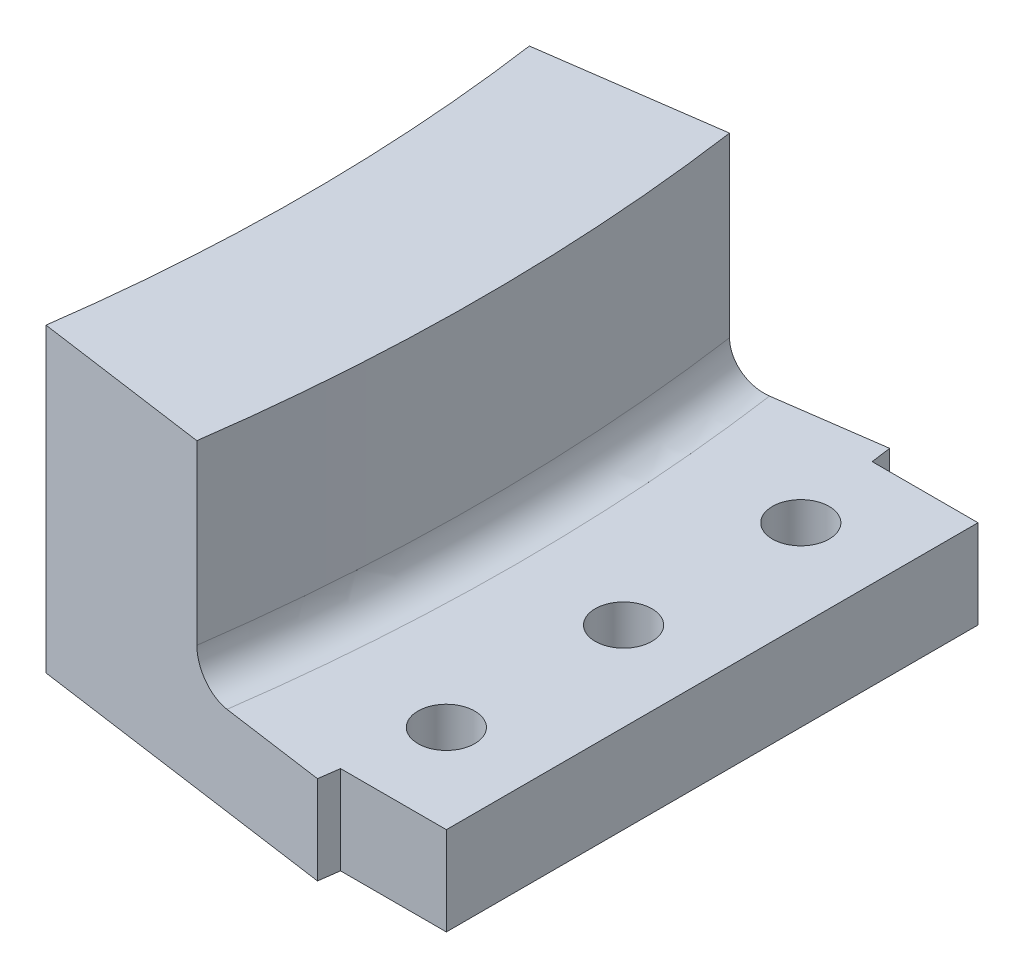
ISO-10303-21;
HEADER;
FILE_DESCRIPTION(('STEP AP214'),'2;1');
FILE_NAME('part.step','',(''),(''),'','','');
FILE_SCHEMA(('AUTOMOTIVE_DESIGN { 1 0 10303 214 1 1 1 1 }'));
ENDSEC;
DATA;
#1=APPLICATION_CONTEXT('core data for automotive mechanical design processes');
#2=APPLICATION_PROTOCOL_DEFINITION('international standard','automotive_design',2000,#1);
#3=PRODUCT_CONTEXT('',#1,'mechanical');
#4=PRODUCT('Part','Part','',(#3));
#5=PRODUCT_RELATED_PRODUCT_CATEGORY('part','',(#4));
#6=PRODUCT_DEFINITION_FORMATION('','',#4);
#7=PRODUCT_DEFINITION_CONTEXT('part definition',#1,'design');
#8=PRODUCT_DEFINITION('design','',#6,#7);
#9=PRODUCT_DEFINITION_SHAPE('','',#8);
#10=(LENGTH_UNIT() NAMED_UNIT(*) SI_UNIT(.MILLI.,.METRE.));
#11=(NAMED_UNIT(*) PLANE_ANGLE_UNIT() SI_UNIT($,.RADIAN.));
#12=(NAMED_UNIT(*) SI_UNIT($,.STERADIAN.) SOLID_ANGLE_UNIT());
#13=UNCERTAINTY_MEASURE_WITH_UNIT(LENGTH_MEASURE(1.E-05),#10,'distance_accuracy_value','');
#14=(GEOMETRIC_REPRESENTATION_CONTEXT(3) GLOBAL_UNCERTAINTY_ASSIGNED_CONTEXT((#13)) GLOBAL_UNIT_ASSIGNED_CONTEXT((#10,
#11,#12)) REPRESENTATION_CONTEXT('',''));
#15=CARTESIAN_POINT('',(0.,0.,0.));
#16=DIRECTION('',(0.,0.,1.));
#17=DIRECTION('',(1.,0.,0.));
#18=AXIS2_PLACEMENT_3D('',#15,#16,#17);
#19=CARTESIAN_POINT('',(0.,-55.,0.));
#20=DIRECTION('',(0.,-1.,0.));
#21=DIRECTION('',(0.,0.,-1.));
#22=AXIS2_PLACEMENT_3D('',#19,#20,#21);
#23=CYLINDRICAL_SURFACE('',#22,116.);
#24=CARTESIAN_POINT('',(0.,5.,0.));
#25=DIRECTION('',(0.,-1.,0.));
#26=DIRECTION('',(0.,0.,-1.));
#27=AXIS2_PLACEMENT_3D('',#24,#25,#26);
#28=CIRCLE('',#27,116.);
#29=CARTESIAN_POINT('',(114.871095974022,5.,-16.1440797113676));
#30=VERTEX_POINT('',#29);
#31=CARTESIAN_POINT('',(115.02608399837,5.,-15.));
#32=VERTEX_POINT('',#31);
#33=EDGE_CURVE('E206',#30,#32,#28,.T.);
#34=ORIENTED_EDGE('',*,*,#33,.T.);
#35=DIRECTION('',(0.,-1.,0.));
#36=VECTOR('',#35,1.);
#37=CARTESIAN_POINT('',(115.02608399837,-55.,-15.));
#38=LINE('',#37,#36);
#39=CARTESIAN_POINT('',(115.02608399837,0.,-15.));
#40=VERTEX_POINT('',#39);
#41=EDGE_CURVE('E162',#32,#40,#38,.T.);
#42=ORIENTED_EDGE('',*,*,#41,.T.);
#43=CARTESIAN_POINT('',(0.,0.,0.));
#44=DIRECTION('',(0.,-1.,0.));
#45=DIRECTION('',(0.,0.,-1.));
#46=AXIS2_PLACEMENT_3D('',#43,#44,#45);
#47=CIRCLE('',#46,116.);
#48=CARTESIAN_POINT('',(114.871095974022,0.,-16.1440797113676));
#49=VERTEX_POINT('',#48);
#50=EDGE_CURVE('E203',#49,#40,#47,.T.);
#51=ORIENTED_EDGE('',*,*,#50,.F.);
#52=DIRECTION('',(0.,1.,0.));
#53=VECTOR('',#52,1.);
#54=CARTESIAN_POINT('',(114.871095974022,0.,-16.1440797113676));
#55=LINE('',#54,#53);
#56=EDGE_CURVE('E190',#49,#30,#55,.T.);
#57=ORIENTED_EDGE('',*,*,#56,.T.);
#58=EDGE_LOOP('',(#34,#42,#51,#57));
#59=FACE_BOUND('',#58,.T.);
#60=ADVANCED_FACE('F35',(#59),#23,.T.);
#61=DIRECTION('',(0.,-1.,0.));
#62=VECTOR('',#61,1.);
#63=CARTESIAN_POINT('',(115.02608399837,-55.,15.));
#64=LINE('',#63,#62);
#65=CARTESIAN_POINT('',(115.02608399837,5.,15.));
#66=VERTEX_POINT('',#65);
#67=CARTESIAN_POINT('',(115.02608399837,0.,15.));
#68=VERTEX_POINT('',#67);
#69=EDGE_CURVE('E136',#66,#68,#64,.T.);
#70=ORIENTED_EDGE('',*,*,#69,.F.);
#71=CARTESIAN_POINT('',(114.871095974022,5.,16.1440797113676));
#72=VERTEX_POINT('',#71);
#73=EDGE_CURVE('E205',#66,#72,#28,.T.);
#74=ORIENTED_EDGE('',*,*,#73,.T.);
#75=DIRECTION('',(0.,1.,0.));
#76=VECTOR('',#75,1.);
#77=CARTESIAN_POINT('',(114.871095974022,0.,16.1440797113676));
#78=LINE('',#77,#76);
#79=CARTESIAN_POINT('',(114.871095974022,0.,16.1440797113676));
#80=VERTEX_POINT('',#79);
#81=EDGE_CURVE('E174',#80,#72,#78,.T.);
#82=ORIENTED_EDGE('',*,*,#81,.F.);
#83=EDGE_CURVE('E202',#68,#80,#47,.T.);
#84=ORIENTED_EDGE('',*,*,#83,.F.);
#85=EDGE_LOOP('',(#70,#74,#82,#84));
#86=FACE_BOUND('',#85,.T.);
#87=ADVANCED_FACE('F228',(#86),#23,.T.);
#88=CARTESIAN_POINT('',(97.0462707366739,17.,-13.6389638940864));
#89=DIRECTION('',(0.,1.,0.));
#90=DIRECTION('',(0.,0.,1.));
#91=AXIS2_PLACEMENT_3D('',#88,#89,#90);
#92=PLANE('',#91);
#93=CARTESIAN_POINT('',(0.,17.,0.));
#94=DIRECTION('',(0.,-1.,0.));
#95=DIRECTION('',(0.,0.,-1.));
#96=AXIS2_PLACEMENT_3D('',#93,#94,#95);
#97=CIRCLE('',#96,108.);
#98=CARTESIAN_POINT('',(106.94895142409,17.,-15.0306949036871));
#99=VERTEX_POINT('',#98);
#100=CARTESIAN_POINT('',(106.94895142409,17.,15.0306949036871));
#101=VERTEX_POINT('',#100);
#102=EDGE_CURVE('E209',#99,#101,#97,.T.);
#103=ORIENTED_EDGE('',*,*,#102,.F.);
#104=DIRECTION('',(-0.99026806874157,0.,0.139173100960066));
#105=VECTOR('',#104,1.);
#106=CARTESIAN_POINT('',(97.0462707366739,17.,-13.6389638940864));
#107=LINE('',#106,#105);
#108=CARTESIAN_POINT('',(97.0462707366739,17.,-13.6389638940864));
#109=VERTEX_POINT('',#108);
#110=EDGE_CURVE('E181',#99,#109,#107,.T.);
#111=ORIENTED_EDGE('',*,*,#110,.T.);
#112=CARTESIAN_POINT('',(0.,17.,0.));
#113=DIRECTION('',(0.,-1.,0.));
#114=DIRECTION('',(0.,0.,-1.));
#115=AXIS2_PLACEMENT_3D('',#112,#113,#114);
#116=CIRCLE('',#115,98.);
#117=CARTESIAN_POINT('',(97.0462707366739,17.,13.6389638940864));
#118=VERTEX_POINT('',#117);
#119=EDGE_CURVE('E198',#109,#118,#116,.T.);
#120=ORIENTED_EDGE('',*,*,#119,.T.);
#121=DIRECTION('',(-0.99026806874157,0.,-0.139173100960066));
#122=VECTOR('',#121,1.);
#123=CARTESIAN_POINT('',(97.0462707366739,17.,13.6389638940864));
#124=LINE('',#123,#122);
#125=EDGE_CURVE('E128',#101,#118,#124,.T.);
#126=ORIENTED_EDGE('',*,*,#125,.F.);
#127=EDGE_LOOP('',(#103,#111,#120,#126));
#128=FACE_BOUND('',#127,.T.);
#129=ADVANCED_FACE('F255',(#128),#92,.T.);
#130=CARTESIAN_POINT('',(0.,-55.,0.));
#131=DIRECTION('',(0.,-1.,0.));
#132=DIRECTION('',(0.,0.,-1.));
#133=AXIS2_PLACEMENT_3D('',#130,#131,#132);
#134=CYLINDRICAL_SURFACE('',#133,108.);
#135=DIRECTION('',(0.,1.,0.));
#136=VECTOR('',#135,1.);
#137=CARTESIAN_POINT('',(106.94895142409,17.,15.0306949036871));
#138=LINE('',#137,#136);
#139=CARTESIAN_POINT('',(106.94895142409,7.,15.0306949036871));
#140=VERTEX_POINT('',#139);
#141=EDGE_CURVE('E179',#140,#101,#138,.T.);
#142=ORIENTED_EDGE('',*,*,#141,.F.);
#143=CARTESIAN_POINT('',(0.,7.,0.));
#144=DIRECTION('',(0.,1.,0.));
#145=DIRECTION('',(0.,0.,1.));
#146=AXIS2_PLACEMENT_3D('',#143,#144,#145);
#147=CIRCLE('',#146,108.);
#148=CARTESIAN_POINT('',(106.94895142409,7.,-15.0306949036871));
#149=VERTEX_POINT('',#148);
#150=EDGE_CURVE('E56',#140,#149,#147,.T.);
#151=ORIENTED_EDGE('',*,*,#150,.T.);
#152=DIRECTION('',(0.,1.,0.));
#153=VECTOR('',#152,1.);
#154=CARTESIAN_POINT('',(106.94895142409,17.,-15.0306949036871));
#155=LINE('',#154,#153);
#156=EDGE_CURVE('E196',#149,#99,#155,.T.);
#157=ORIENTED_EDGE('',*,*,#156,.T.);
#158=ORIENTED_EDGE('',*,*,#102,.T.);
#159=EDGE_LOOP('',(#142,#151,#157,#158));
#160=FACE_BOUND('',#159,.T.);
#161=ADVANCED_FACE('F260',(#160),#134,.T.);
#162=CARTESIAN_POINT('',(106.94895142409,5.,-15.0306949036871));
#163=DIRECTION('',(0.,1.,0.));
#164=DIRECTION('',(0.,0.,1.));
#165=AXIS2_PLACEMENT_3D('',#162,#163,#164);
#166=PLANE('',#165);
#167=CARTESIAN_POINT('',(116.,5.,0.));
#168=DIRECTION('',(0.,1.,0.));
#169=DIRECTION('',(0.,0.,1.));
#170=AXIS2_PLACEMENT_3D('',#167,#168,#169);
#171=CIRCLE('',#170,1.60000000000001);
#172=CARTESIAN_POINT('',(116.,5.,1.60000000000001));
#173=VERTEX_POINT('',#172);
#174=EDGE_CURVE('E447',#173,#173,#171,.T.);
#175=ORIENTED_EDGE('',*,*,#174,.F.);
#176=EDGE_LOOP('',(#175));
#177=FACE_BOUND('',#176,.T.);
#178=CARTESIAN_POINT('',(116.,5.,10.));
#179=DIRECTION('',(0.,1.,0.));
#180=DIRECTION('',(0.,0.,1.));
#181=AXIS2_PLACEMENT_3D('',#178,#179,#180);
#182=CIRCLE('',#181,1.59999999999999);
#183=CARTESIAN_POINT('',(116.,5.,11.6));
#184=VERTEX_POINT('',#183);
#185=EDGE_CURVE('E141',#184,#184,#182,.F.);
#186=ORIENTED_EDGE('',*,*,#185,.T.);
#187=EDGE_LOOP('',(#186));
#188=FACE_BOUND('',#187,.T.);
#189=DIRECTION('',(-0.99026806874157,0.,0.139173100960066));
#190=VECTOR('',#189,1.);
#191=CARTESIAN_POINT('',(106.94895142409,5.,-15.0306949036871));
#192=LINE('',#191,#190);
#193=CARTESIAN_POINT('',(108.929487561573,5.,-15.3090411056072));
#194=VERTEX_POINT('',#193);
#195=EDGE_CURVE('E193',#30,#194,#192,.T.);
#196=ORIENTED_EDGE('',*,*,#195,.T.);
#197=CARTESIAN_POINT('',(0.,5.,0.));
#198=DIRECTION('',(0.,1.,0.));
#199=DIRECTION('',(0.,0.,1.));
#200=AXIS2_PLACEMENT_3D('',#197,#198,#199);
#201=CIRCLE('',#200,110.);
#202=CARTESIAN_POINT('',(108.929487561573,5.,15.3090411056072));
#203=VERTEX_POINT('',#202);
#204=EDGE_CURVE('E212',#194,#203,#201,.F.);
#205=ORIENTED_EDGE('',*,*,#204,.T.);
#206=DIRECTION('',(-0.99026806874157,0.,-0.139173100960066));
#207=VECTOR('',#206,1.);
#208=CARTESIAN_POINT('',(106.94895142409,5.,15.0306949036871));
#209=LINE('',#208,#207);
#210=EDGE_CURVE('E177',#72,#203,#209,.T.);
#211=ORIENTED_EDGE('',*,*,#210,.F.);
#212=ORIENTED_EDGE('',*,*,#73,.F.);
#213=DIRECTION('',(-1.,0.,0.));
#214=VECTOR('',#213,1.);
#215=CARTESIAN_POINT('',(121.,5.,15.));
#216=LINE('',#215,#214);
#217=CARTESIAN_POINT('',(121.,5.,15.));
#218=VERTEX_POINT('',#217);
#219=EDGE_CURVE('E137',#218,#66,#216,.T.);
#220=ORIENTED_EDGE('',*,*,#219,.F.);
#221=DIRECTION('',(0.,0.,1.));
#222=VECTOR('',#221,1.);
#223=CARTESIAN_POINT('',(121.,5.,-5.00000000000001));
#224=LINE('',#223,#222);
#225=CARTESIAN_POINT('',(121.,5.,-15.));
#226=VERTEX_POINT('',#225);
#227=EDGE_CURVE('E129',#226,#218,#224,.T.);
#228=ORIENTED_EDGE('',*,*,#227,.F.);
#229=DIRECTION('',(-1.,0.,0.));
#230=VECTOR('',#229,1.);
#231=CARTESIAN_POINT('',(121.,5.,-15.));
#232=LINE('',#231,#230);
#233=EDGE_CURVE('E159',#226,#32,#232,.T.);
#234=ORIENTED_EDGE('',*,*,#233,.T.);
#235=ORIENTED_EDGE('',*,*,#33,.F.);
#236=EDGE_LOOP('',(#196,#205,#211,#212,#220,#228,#234,#235));
#237=FACE_BOUND('',#236,.T.);
#238=CARTESIAN_POINT('',(116.,5.,-10.));
#239=DIRECTION('',(0.,1.,0.));
#240=DIRECTION('',(0.,0.,1.));
#241=AXIS2_PLACEMENT_3D('',#238,#239,#240);
#242=CIRCLE('',#241,1.59999999999999);
#243=CARTESIAN_POINT('',(116.,5.,-8.40000000000002));
#244=VERTEX_POINT('',#243);
#245=EDGE_CURVE('E150',#244,#244,#242,.T.);
#246=ORIENTED_EDGE('',*,*,#245,.F.);
#247=EDGE_LOOP('',(#246));
#248=FACE_BOUND('',#247,.T.);
#249=ADVANCED_FACE('F218',(#177,#188,#237,#248),#166,.T.);
#250=CARTESIAN_POINT('',(97.0462707366739,0.,-13.6389638940864));
#251=DIRECTION('',(0.,-1.,0.));
#252=DIRECTION('',(0.,0.,-1.));
#253=AXIS2_PLACEMENT_3D('',#250,#251,#252);
#254=PLANE('',#253);
#255=CARTESIAN_POINT('',(116.,0.,0.));
#256=DIRECTION('',(0.,1.,0.));
#257=DIRECTION('',(0.,0.,1.));
#258=AXIS2_PLACEMENT_3D('',#255,#256,#257);
#259=CIRCLE('',#258,1.60000000000001);
#260=CARTESIAN_POINT('',(116.,0.,1.60000000000001));
#261=VERTEX_POINT('',#260);
#262=EDGE_CURVE('E443',#261,#261,#259,.T.);
#263=ORIENTED_EDGE('',*,*,#262,.T.);
#264=EDGE_LOOP('',(#263));
#265=FACE_BOUND('',#264,.T.);
#266=CARTESIAN_POINT('',(116.,0.,10.));
#267=DIRECTION('',(0.,1.,0.));
#268=DIRECTION('',(0.,0.,1.));
#269=AXIS2_PLACEMENT_3D('',#266,#267,#268);
#270=CIRCLE('',#269,1.59999999999999);
#271=CARTESIAN_POINT('',(116.,0.,11.6));
#272=VERTEX_POINT('',#271);
#273=EDGE_CURVE('E145',#272,#272,#270,.T.);
#274=ORIENTED_EDGE('',*,*,#273,.T.);
#275=EDGE_LOOP('',(#274));
#276=FACE_BOUND('',#275,.T.);
#277=DIRECTION('',(-1.,0.,0.));
#278=VECTOR('',#277,1.);
#279=CARTESIAN_POINT('',(121.,0.,15.));
#280=LINE('',#279,#278);
#281=CARTESIAN_POINT('',(121.,0.,15.));
#282=VERTEX_POINT('',#281);
#283=EDGE_CURVE('E120',#282,#68,#280,.T.);
#284=ORIENTED_EDGE('',*,*,#283,.T.);
#285=ORIENTED_EDGE('',*,*,#83,.T.);
#286=DIRECTION('',(0.99026806874157,0.,0.139173100960066));
#287=VECTOR('',#286,1.);
#288=CARTESIAN_POINT('',(97.0462707366739,0.,13.6389638940864));
#289=LINE('',#288,#287);
#290=CARTESIAN_POINT('',(97.0462707366739,0.,13.6389638940864));
#291=VERTEX_POINT('',#290);
#292=EDGE_CURVE('E171',#291,#80,#289,.T.);
#293=ORIENTED_EDGE('',*,*,#292,.F.);
#294=CARTESIAN_POINT('',(0.,0.,0.));
#295=DIRECTION('',(0.,-1.,0.));
#296=DIRECTION('',(0.,0.,-1.));
#297=AXIS2_PLACEMENT_3D('',#294,#295,#296);
#298=CIRCLE('',#297,98.);
#299=CARTESIAN_POINT('',(97.0462707366739,0.,-13.6389638940864));
#300=VERTEX_POINT('',#299);
#301=EDGE_CURVE('E200',#300,#291,#298,.T.);
#302=ORIENTED_EDGE('',*,*,#301,.F.);
#303=DIRECTION('',(0.99026806874157,0.,-0.139173100960066));
#304=VECTOR('',#303,1.);
#305=CARTESIAN_POINT('',(97.0462707366739,0.,-13.6389638940864));
#306=LINE('',#305,#304);
#307=EDGE_CURVE('E187',#300,#49,#306,.T.);
#308=ORIENTED_EDGE('',*,*,#307,.T.);
#309=ORIENTED_EDGE('',*,*,#50,.T.);
#310=DIRECTION('',(-1.,0.,0.));
#311=VECTOR('',#310,1.);
#312=CARTESIAN_POINT('',(121.,0.,-15.));
#313=LINE('',#312,#311);
#314=CARTESIAN_POINT('',(121.,0.,-15.));
#315=VERTEX_POINT('',#314);
#316=EDGE_CURVE('E123',#315,#40,#313,.T.);
#317=ORIENTED_EDGE('',*,*,#316,.F.);
#318=DIRECTION('',(0.,0.,-1.));
#319=VECTOR('',#318,1.);
#320=CARTESIAN_POINT('',(121.,0.,4.99999999999999));
#321=LINE('',#320,#319);
#322=EDGE_CURVE('E116',#282,#315,#321,.T.);
#323=ORIENTED_EDGE('',*,*,#322,.F.);
#324=EDGE_LOOP('',(#284,#285,#293,#302,#308,#309,#317,#323));
#325=FACE_BOUND('',#324,.T.);
#326=CARTESIAN_POINT('',(116.,0.,-10.));
#327=DIRECTION('',(0.,-1.,0.));
#328=DIRECTION('',(0.,0.,-1.));
#329=AXIS2_PLACEMENT_3D('',#326,#327,#328);
#330=CIRCLE('',#329,1.59999999999999);
#331=CARTESIAN_POINT('',(116.,0.,-11.6));
#332=VERTEX_POINT('',#331);
#333=EDGE_CURVE('E153',#332,#332,#330,.T.);
#334=ORIENTED_EDGE('',*,*,#333,.F.);
#335=EDGE_LOOP('',(#334));
#336=FACE_BOUND('',#335,.T.);
#337=ADVANCED_FACE('F118',(#265,#276,#325,#336),#254,.T.);
#338=CARTESIAN_POINT('',(0.,-55.,0.));
#339=DIRECTION('',(0.,-1.,0.));
#340=DIRECTION('',(0.,0.,-1.));
#341=AXIS2_PLACEMENT_3D('',#338,#339,#340);
#342=CYLINDRICAL_SURFACE('',#341,98.);
#343=DIRECTION('',(0.,-1.,0.));
#344=VECTOR('',#343,1.);
#345=CARTESIAN_POINT('',(97.0462707366739,17.,-13.6389638940864));
#346=LINE('',#345,#344);
#347=EDGE_CURVE('E184',#109,#300,#346,.T.);
#348=ORIENTED_EDGE('',*,*,#347,.T.);
#349=ORIENTED_EDGE('',*,*,#301,.T.);
#350=DIRECTION('',(0.,-1.,0.));
#351=VECTOR('',#350,1.);
#352=CARTESIAN_POINT('',(97.0462707366739,17.,13.6389638940864));
#353=LINE('',#352,#351);
#354=EDGE_CURVE('E168',#118,#291,#353,.T.);
#355=ORIENTED_EDGE('',*,*,#354,.F.);
#356=ORIENTED_EDGE('',*,*,#119,.F.);
#357=EDGE_LOOP('',(#348,#349,#355,#356));
#358=FACE_BOUND('',#357,.T.);
#359=ADVANCED_FACE('F272',(#358),#342,.F.);
#360=CARTESIAN_POINT('',(0.,0.,0.));
#361=DIRECTION('',(-0.139173100960066,0.,-0.99026806874157));
#362=DIRECTION('',(-0.99026806874157,0.,0.139173100960066));
#363=AXIS2_PLACEMENT_3D('',#360,#361,#362);
#364=PLANE('',#363);
#365=ORIENTED_EDGE('',*,*,#110,.F.);
#366=ORIENTED_EDGE('',*,*,#156,.F.);
#367=CARTESIAN_POINT('',(108.929487561573,7.,-15.3090411056072));
#368=DIRECTION('',(-0.139173100960066,0.,-0.99026806874157));
#369=DIRECTION('',(-0.99026806874157,0.,0.139173100960066));
#370=AXIS2_PLACEMENT_3D('',#367,#368,#369);
#371=CIRCLE('',#370,2.);
#372=EDGE_CURVE('E11',#149,#194,#371,.F.);
#373=ORIENTED_EDGE('',*,*,#372,.T.);
#374=ORIENTED_EDGE('',*,*,#195,.F.);
#375=ORIENTED_EDGE('',*,*,#56,.F.);
#376=ORIENTED_EDGE('',*,*,#307,.F.);
#377=ORIENTED_EDGE('',*,*,#347,.F.);
#378=EDGE_LOOP('',(#365,#366,#373,#374,#375,#376,#377));
#379=FACE_BOUND('',#378,.T.);
#380=ADVANCED_FACE('F238',(#379),#364,.T.);
#381=CARTESIAN_POINT('',(0.,0.,0.));
#382=DIRECTION('',(0.139173100960066,0.,-0.99026806874157));
#383=DIRECTION('',(-0.99026806874157,0.,-0.139173100960066));
#384=AXIS2_PLACEMENT_3D('',#381,#382,#383);
#385=PLANE('',#384);
#386=ORIENTED_EDGE('',*,*,#125,.T.);
#387=ORIENTED_EDGE('',*,*,#354,.T.);
#388=ORIENTED_EDGE('',*,*,#292,.T.);
#389=ORIENTED_EDGE('',*,*,#81,.T.);
#390=ORIENTED_EDGE('',*,*,#210,.T.);
#391=CARTESIAN_POINT('',(108.929487561573,7.,15.3090411056072));
#392=DIRECTION('',(0.139173100960066,0.,-0.99026806874157));
#393=DIRECTION('',(-0.99026806874157,0.,-0.139173100960066));
#394=AXIS2_PLACEMENT_3D('',#391,#392,#393);
#395=CIRCLE('',#394,2.);
#396=EDGE_CURVE('E43',#203,#140,#395,.T.);
#397=ORIENTED_EDGE('',*,*,#396,.T.);
#398=ORIENTED_EDGE('',*,*,#141,.T.);
#399=EDGE_LOOP('',(#386,#387,#388,#389,#390,#397,#398));
#400=FACE_BOUND('',#399,.T.);
#401=ADVANCED_FACE('F224',(#400),#385,.F.);
#402=CARTESIAN_POINT('',(121.,0.,0.));
#403=DIRECTION('',(1.,0.,0.));
#404=DIRECTION('',(0.,0.,-1.));
#405=AXIS2_PLACEMENT_3D('',#402,#403,#404);
#406=PLANE('',#405);
#407=ORIENTED_EDGE('',*,*,#227,.T.);
#408=DIRECTION('',(0.,1.,0.));
#409=VECTOR('',#408,1.);
#410=CARTESIAN_POINT('',(121.,0.,15.));
#411=LINE('',#410,#409);
#412=EDGE_CURVE('E134',#282,#218,#411,.T.);
#413=ORIENTED_EDGE('',*,*,#412,.F.);
#414=ORIENTED_EDGE('',*,*,#322,.T.);
#415=DIRECTION('',(0.,1.,0.));
#416=VECTOR('',#415,1.);
#417=CARTESIAN_POINT('',(121.,0.,-15.));
#418=LINE('',#417,#416);
#419=EDGE_CURVE('E156',#315,#226,#418,.T.);
#420=ORIENTED_EDGE('',*,*,#419,.T.);
#421=EDGE_LOOP('',(#407,#413,#414,#420));
#422=FACE_BOUND('',#421,.T.);
#423=ADVANCED_FACE('F139',(#422),#406,.T.);
#424=CARTESIAN_POINT('',(121.,0.,-15.));
#425=DIRECTION('',(0.,0.,1.));
#426=DIRECTION('',(1.,0.,0.));
#427=AXIS2_PLACEMENT_3D('',#424,#425,#426);
#428=PLANE('',#427);
#429=ORIENTED_EDGE('',*,*,#41,.F.);
#430=ORIENTED_EDGE('',*,*,#233,.F.);
#431=ORIENTED_EDGE('',*,*,#419,.F.);
#432=ORIENTED_EDGE('',*,*,#316,.T.);
#433=EDGE_LOOP('',(#429,#430,#431,#432));
#434=FACE_BOUND('',#433,.T.);
#435=ADVANCED_FACE('F231',(#434),#428,.F.);
#436=CARTESIAN_POINT('',(116.,17.,-10.));
#437=DIRECTION('',(0.,-1.,0.));
#438=DIRECTION('',(0.,0.,-1.));
#439=AXIS2_PLACEMENT_3D('',#436,#437,#438);
#440=CYLINDRICAL_SURFACE('',#439,1.59999999999999);
#441=ORIENTED_EDGE('',*,*,#245,.T.);
#442=EDGE_LOOP('',(#441));
#443=FACE_BOUND('',#442,.T.);
#444=ORIENTED_EDGE('',*,*,#333,.T.);
#445=EDGE_LOOP('',(#444));
#446=FACE_BOUND('',#445,.T.);
#447=ADVANCED_FACE('F287',(#443,#446),#440,.F.);
#448=CARTESIAN_POINT('',(121.,0.,15.));
#449=DIRECTION('',(0.,0.,1.));
#450=DIRECTION('',(1.,0.,0.));
#451=AXIS2_PLACEMENT_3D('',#448,#449,#450);
#452=PLANE('',#451);
#453=ORIENTED_EDGE('',*,*,#219,.T.);
#454=ORIENTED_EDGE('',*,*,#69,.T.);
#455=ORIENTED_EDGE('',*,*,#283,.F.);
#456=ORIENTED_EDGE('',*,*,#412,.T.);
#457=EDGE_LOOP('',(#453,#454,#455,#456));
#458=FACE_BOUND('',#457,.T.);
#459=ADVANCED_FACE('F133',(#458),#452,.T.);
#460=CARTESIAN_POINT('',(116.,17.,10.));
#461=DIRECTION('',(0.,-1.,0.));
#462=DIRECTION('',(0.,0.,-1.));
#463=AXIS2_PLACEMENT_3D('',#460,#461,#462);
#464=CYLINDRICAL_SURFACE('',#463,1.59999999999999);
#465=ORIENTED_EDGE('',*,*,#185,.F.);
#466=EDGE_LOOP('',(#465));
#467=FACE_BOUND('',#466,.T.);
#468=ORIENTED_EDGE('',*,*,#273,.F.);
#469=EDGE_LOOP('',(#468));
#470=FACE_BOUND('',#469,.T.);
#471=ADVANCED_FACE('F241',(#467,#470),#464,.F.);
#472=CARTESIAN_POINT('',(0.,7.,0.));
#473=DIRECTION('',(0.,1.,0.));
#474=DIRECTION('',(0.,0.,1.));
#475=AXIS2_PLACEMENT_3D('',#472,#473,#474);
#476=TOROIDAL_SURFACE('',#475,110.,2.);
#477=ORIENTED_EDGE('',*,*,#372,.F.);
#478=ORIENTED_EDGE('',*,*,#150,.F.);
#479=ORIENTED_EDGE('',*,*,#396,.F.);
#480=ORIENTED_EDGE('',*,*,#204,.F.);
#481=EDGE_LOOP('',(#477,#478,#479,#480));
#482=FACE_BOUND('',#481,.T.);
#483=ADVANCED_FACE('F37',(#482),#476,.F.);
#484=CARTESIAN_POINT('',(116.,0.,0.));
#485=DIRECTION('',(0.,1.,0.));
#486=DIRECTION('',(0.,0.,1.));
#487=AXIS2_PLACEMENT_3D('',#484,#485,#486);
#488=CYLINDRICAL_SURFACE('',#487,1.60000000000001);
#489=ORIENTED_EDGE('',*,*,#262,.F.);
#490=EDGE_LOOP('',(#489));
#491=FACE_BOUND('',#490,.T.);
#492=ORIENTED_EDGE('',*,*,#174,.T.);
#493=EDGE_LOOP('',(#492));
#494=FACE_BOUND('',#493,.T.);
#495=ADVANCED_FACE('F240',(#491,#494),#488,.F.);
#496=CLOSED_SHELL('',(#60,#87,#129,#161,#249,#337,#359,#380,#401,#423,#435,#447,#459,#471,#483,#495));
#497=MANIFOLD_SOLID_BREP('B2',#496);
#498=ADVANCED_BREP_SHAPE_REPRESENTATION('',(#18,#497),#14);
#499=SHAPE_DEFINITION_REPRESENTATION(#9,#498);
ENDSEC;
END-ISO-10303-21;
